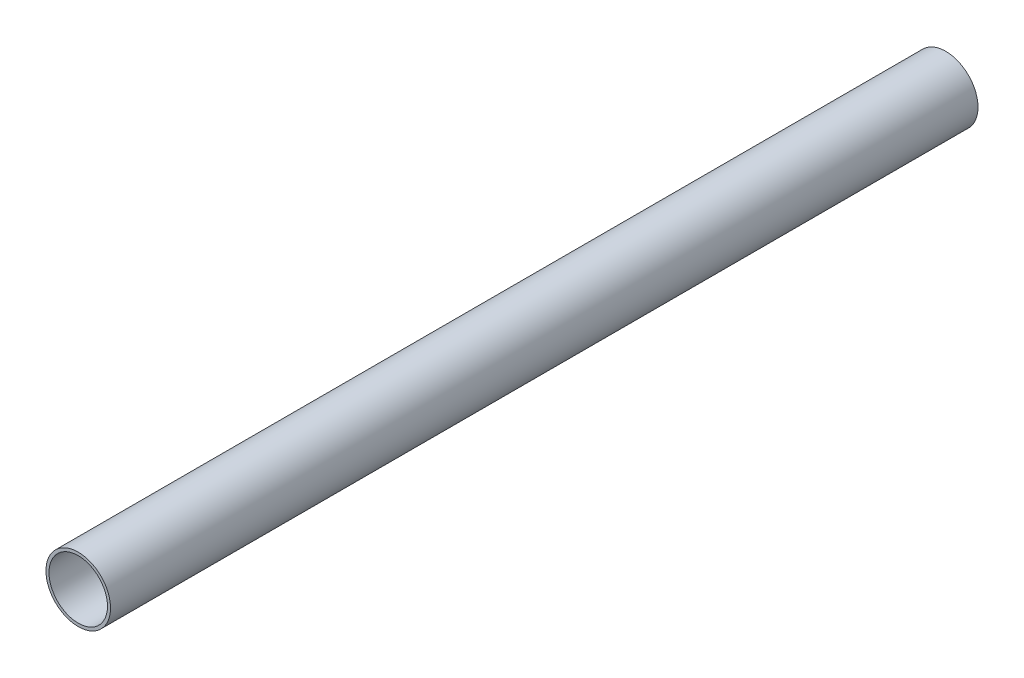
ISO-10303-21;
HEADER;
FILE_DESCRIPTION(('STEP AP214'),'2;1');
FILE_NAME('part.step','',(''),(''),'','','');
FILE_SCHEMA(('AUTOMOTIVE_DESIGN { 1 0 10303 214 1 1 1 1 }'));
ENDSEC;
DATA;
#1=APPLICATION_CONTEXT('core data for automotive mechanical design processes');
#2=APPLICATION_PROTOCOL_DEFINITION('international standard','automotive_design',2000,#1);
#3=PRODUCT_CONTEXT('',#1,'mechanical');
#4=PRODUCT('Part','Part','',(#3));
#5=PRODUCT_RELATED_PRODUCT_CATEGORY('part','',(#4));
#6=PRODUCT_DEFINITION_FORMATION('','',#4);
#7=PRODUCT_DEFINITION_CONTEXT('part definition',#1,'design');
#8=PRODUCT_DEFINITION('design','',#6,#7);
#9=PRODUCT_DEFINITION_SHAPE('','',#8);
#10=(LENGTH_UNIT() NAMED_UNIT(*) SI_UNIT(.MILLI.,.METRE.));
#11=(NAMED_UNIT(*) PLANE_ANGLE_UNIT() SI_UNIT($,.RADIAN.));
#12=(NAMED_UNIT(*) SI_UNIT($,.STERADIAN.) SOLID_ANGLE_UNIT());
#13=UNCERTAINTY_MEASURE_WITH_UNIT(LENGTH_MEASURE(1.E-05),#10,'distance_accuracy_value','');
#14=(GEOMETRIC_REPRESENTATION_CONTEXT(3) GLOBAL_UNCERTAINTY_ASSIGNED_CONTEXT((#13)) GLOBAL_UNIT_ASSIGNED_CONTEXT((#10,
#11,#12)) REPRESENTATION_CONTEXT('',''));
#15=CARTESIAN_POINT('',(0.,0.,0.));
#16=DIRECTION('',(0.,0.,1.));
#17=DIRECTION('',(1.,0.,0.));
#18=AXIS2_PLACEMENT_3D('',#15,#16,#17);
#19=CARTESIAN_POINT('',(0.,0.,215.));
#20=DIRECTION('',(0.,0.,1.));
#21=DIRECTION('',(1.,0.,0.));
#22=AXIS2_PLACEMENT_3D('',#19,#20,#21);
#23=PLANE('',#22);
#24=CARTESIAN_POINT('',(0.,0.,215.));
#25=DIRECTION('',(0.,0.,1.));
#26=DIRECTION('',(1.,0.,0.));
#27=AXIS2_PLACEMENT_3D('',#24,#25,#26);
#28=CIRCLE('',#27,16.);
#29=CARTESIAN_POINT('',(16.,0.,215.));
#30=VERTEX_POINT('',#29);
#31=EDGE_CURVE('E10',#30,#30,#28,.T.);
#32=ORIENTED_EDGE('',*,*,#31,.T.);
#33=EDGE_LOOP('',(#32));
#34=FACE_BOUND('',#33,.T.);
#35=CARTESIAN_POINT('',(0.,0.,215.));
#36=DIRECTION('',(0.,0.,1.));
#37=DIRECTION('',(1.,0.,0.));
#38=AXIS2_PLACEMENT_3D('',#35,#36,#37);
#39=CIRCLE('',#38,14.5);
#40=CARTESIAN_POINT('',(14.5,0.,215.));
#41=VERTEX_POINT('',#40);
#42=EDGE_CURVE('E43',#41,#41,#39,.T.);
#43=ORIENTED_EDGE('',*,*,#42,.F.);
#44=EDGE_LOOP('',(#43));
#45=FACE_BOUND('',#44,.T.);
#46=ADVANCED_FACE('F32',(#34,#45),#23,.T.);
#47=CARTESIAN_POINT('',(0.,0.,-215.));
#48=DIRECTION('',(0.,0.,1.));
#49=DIRECTION('',(1.,0.,0.));
#50=AXIS2_PLACEMENT_3D('',#47,#48,#49);
#51=PLANE('',#50);
#52=CARTESIAN_POINT('',(0.,0.,-215.));
#53=DIRECTION('',(0.,0.,1.));
#54=DIRECTION('',(1.,0.,0.));
#55=AXIS2_PLACEMENT_3D('',#52,#53,#54);
#56=CIRCLE('',#55,16.);
#57=CARTESIAN_POINT('',(16.,0.,-215.));
#58=VERTEX_POINT('',#57);
#59=EDGE_CURVE('E36',#58,#58,#56,.T.);
#60=ORIENTED_EDGE('',*,*,#59,.F.);
#61=EDGE_LOOP('',(#60));
#62=FACE_BOUND('',#61,.T.);
#63=CARTESIAN_POINT('',(0.,0.,-215.));
#64=DIRECTION('',(0.,0.,1.));
#65=DIRECTION('',(1.,0.,0.));
#66=AXIS2_PLACEMENT_3D('',#63,#64,#65);
#67=CIRCLE('',#66,14.5);
#68=CARTESIAN_POINT('',(14.5,0.,-215.));
#69=VERTEX_POINT('',#68);
#70=EDGE_CURVE('E45',#69,#69,#67,.T.);
#71=ORIENTED_EDGE('',*,*,#70,.T.);
#72=EDGE_LOOP('',(#71));
#73=FACE_BOUND('',#72,.T.);
#74=ADVANCED_FACE('F55',(#62,#73),#51,.F.);
#75=CARTESIAN_POINT('',(0.,0.,215.));
#76=DIRECTION('',(0.,0.,-1.));
#77=DIRECTION('',(-1.,0.,0.));
#78=AXIS2_PLACEMENT_3D('',#75,#76,#77);
#79=CYLINDRICAL_SURFACE('',#78,16.);
#80=ORIENTED_EDGE('',*,*,#31,.F.);
#81=EDGE_LOOP('',(#80));
#82=FACE_BOUND('',#81,.T.);
#83=ORIENTED_EDGE('',*,*,#59,.T.);
#84=EDGE_LOOP('',(#83));
#85=FACE_BOUND('',#84,.T.);
#86=ADVANCED_FACE('F34',(#82,#85),#79,.T.);
#87=CARTESIAN_POINT('',(0.,0.,215.));
#88=DIRECTION('',(0.,0.,-1.));
#89=DIRECTION('',(-1.,0.,0.));
#90=AXIS2_PLACEMENT_3D('',#87,#88,#89);
#91=CYLINDRICAL_SURFACE('',#90,14.5);
#92=ORIENTED_EDGE('',*,*,#42,.T.);
#93=EDGE_LOOP('',(#92));
#94=FACE_BOUND('',#93,.T.);
#95=ORIENTED_EDGE('',*,*,#70,.F.);
#96=EDGE_LOOP('',(#95));
#97=FACE_BOUND('',#96,.T.);
#98=ADVANCED_FACE('F51',(#94,#97),#91,.F.);
#99=CLOSED_SHELL('',(#46,#74,#86,#98));
#100=MANIFOLD_SOLID_BREP('B2',#99);
#101=ADVANCED_BREP_SHAPE_REPRESENTATION('',(#18,#100),#14);
#102=SHAPE_DEFINITION_REPRESENTATION(#9,#101);
ENDSEC;
END-ISO-10303-21;
